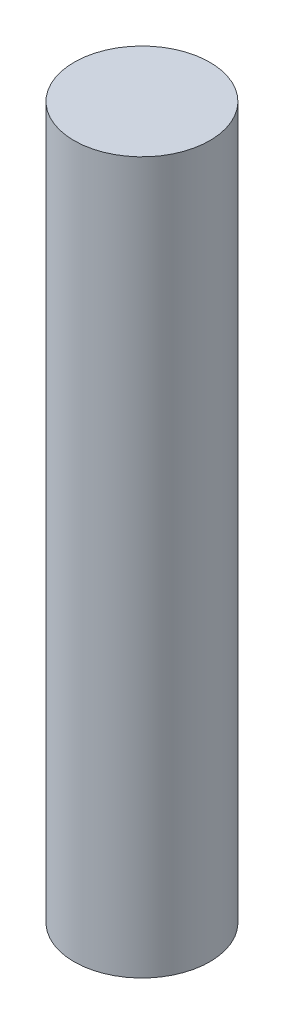
ISO-10303-21;
HEADER;
FILE_DESCRIPTION(('STEP AP214'),'2;1');
FILE_NAME('part.step','',(''),(''),'','','');
FILE_SCHEMA(('AUTOMOTIVE_DESIGN { 1 0 10303 214 1 1 1 1 }'));
ENDSEC;
DATA;
#1=APPLICATION_CONTEXT('core data for automotive mechanical design processes');
#2=APPLICATION_PROTOCOL_DEFINITION('international standard','automotive_design',2000,#1);
#3=PRODUCT_CONTEXT('',#1,'mechanical');
#4=PRODUCT('Part','Part','',(#3));
#5=PRODUCT_RELATED_PRODUCT_CATEGORY('part','',(#4));
#6=PRODUCT_DEFINITION_FORMATION('','',#4);
#7=PRODUCT_DEFINITION_CONTEXT('part definition',#1,'design');
#8=PRODUCT_DEFINITION('design','',#6,#7);
#9=PRODUCT_DEFINITION_SHAPE('','',#8);
#10=(LENGTH_UNIT() NAMED_UNIT(*) SI_UNIT(.MILLI.,.METRE.));
#11=(NAMED_UNIT(*) PLANE_ANGLE_UNIT() SI_UNIT($,.RADIAN.));
#12=(NAMED_UNIT(*) SI_UNIT($,.STERADIAN.) SOLID_ANGLE_UNIT());
#13=UNCERTAINTY_MEASURE_WITH_UNIT(LENGTH_MEASURE(1.E-05),#10,'distance_accuracy_value','');
#14=(GEOMETRIC_REPRESENTATION_CONTEXT(3) GLOBAL_UNCERTAINTY_ASSIGNED_CONTEXT((#13)) GLOBAL_UNIT_ASSIGNED_CONTEXT((#10,
#11,#12)) REPRESENTATION_CONTEXT('',''));
#15=CARTESIAN_POINT('',(0.,0.,0.));
#16=DIRECTION('',(0.,0.,1.));
#17=DIRECTION('',(1.,0.,0.));
#18=AXIS2_PLACEMENT_3D('',#15,#16,#17);
#19=CARTESIAN_POINT('',(0.,220.,0.));
#20=DIRECTION('',(0.,-1.,0.));
#21=DIRECTION('',(0.,0.,-1.));
#22=AXIS2_PLACEMENT_3D('',#19,#20,#21);
#23=CYLINDRICAL_SURFACE('',#22,21.);
#24=CARTESIAN_POINT('',(0.,220.,0.));
#25=DIRECTION('',(0.,1.,0.));
#26=DIRECTION('',(0.,0.,1.));
#27=AXIS2_PLACEMENT_3D('',#24,#25,#26);
#28=CIRCLE('',#27,21.);
#29=CARTESIAN_POINT('',(0.,220.,21.));
#30=VERTEX_POINT('',#29);
#31=EDGE_CURVE('E10',#30,#30,#28,.T.);
#32=ORIENTED_EDGE('',*,*,#31,.F.);
#33=EDGE_LOOP('',(#32));
#34=FACE_BOUND('',#33,.T.);
#35=CARTESIAN_POINT('',(0.,0.,0.));
#36=DIRECTION('',(0.,1.,0.));
#37=DIRECTION('',(0.,0.,1.));
#38=AXIS2_PLACEMENT_3D('',#35,#36,#37);
#39=CIRCLE('',#38,21.);
#40=CARTESIAN_POINT('',(0.,0.,21.));
#41=VERTEX_POINT('',#40);
#42=EDGE_CURVE('E38',#41,#41,#39,.T.);
#43=ORIENTED_EDGE('',*,*,#42,.T.);
#44=EDGE_LOOP('',(#43));
#45=FACE_BOUND('',#44,.T.);
#46=ADVANCED_FACE('F35',(#34,#45),#23,.T.);
#47=CARTESIAN_POINT('',(0.,220.,0.));
#48=DIRECTION('',(0.,1.,0.));
#49=DIRECTION('',(0.,0.,1.));
#50=AXIS2_PLACEMENT_3D('',#47,#48,#49);
#51=PLANE('',#50);
#52=ORIENTED_EDGE('',*,*,#31,.T.);
#53=EDGE_LOOP('',(#52));
#54=FACE_BOUND('',#53,.T.);
#55=ADVANCED_FACE('F50',(#54),#51,.T.);
#56=CARTESIAN_POINT('',(0.,0.,0.));
#57=DIRECTION('',(0.,1.,0.));
#58=DIRECTION('',(0.,0.,1.));
#59=AXIS2_PLACEMENT_3D('',#56,#57,#58);
#60=PLANE('',#59);
#61=ORIENTED_EDGE('',*,*,#42,.F.);
#62=EDGE_LOOP('',(#61));
#63=FACE_BOUND('',#62,.T.);
#64=ADVANCED_FACE('F48',(#63),#60,.F.);
#65=CLOSED_SHELL('',(#46,#55,#64));
#66=MANIFOLD_SOLID_BREP('B2',#65);
#67=ADVANCED_BREP_SHAPE_REPRESENTATION('',(#18,#66),#14);
#68=SHAPE_DEFINITION_REPRESENTATION(#9,#67);
ENDSEC;
END-ISO-10303-21;
